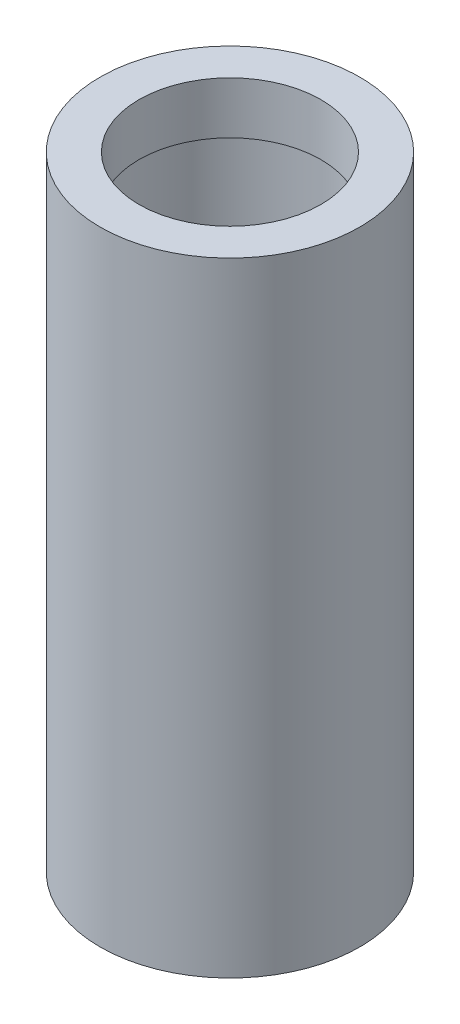
ISO-10303-21;
HEADER;
FILE_DESCRIPTION(('STEP AP214'),'2;1');
FILE_NAME('part.step','',(''),(''),'','','');
FILE_SCHEMA(('AUTOMOTIVE_DESIGN { 1 0 10303 214 1 1 1 1 }'));
ENDSEC;
DATA;
#1=APPLICATION_CONTEXT('core data for automotive mechanical design processes');
#2=APPLICATION_PROTOCOL_DEFINITION('international standard','automotive_design',2000,#1);
#3=PRODUCT_CONTEXT('',#1,'mechanical');
#4=PRODUCT('Part','Part','',(#3));
#5=PRODUCT_RELATED_PRODUCT_CATEGORY('part','',(#4));
#6=PRODUCT_DEFINITION_FORMATION('','',#4);
#7=PRODUCT_DEFINITION_CONTEXT('part definition',#1,'design');
#8=PRODUCT_DEFINITION('design','',#6,#7);
#9=PRODUCT_DEFINITION_SHAPE('','',#8);
#10=(LENGTH_UNIT() NAMED_UNIT(*) SI_UNIT(.MILLI.,.METRE.));
#11=(NAMED_UNIT(*) PLANE_ANGLE_UNIT() SI_UNIT($,.RADIAN.));
#12=(NAMED_UNIT(*) SI_UNIT($,.STERADIAN.) SOLID_ANGLE_UNIT());
#13=UNCERTAINTY_MEASURE_WITH_UNIT(LENGTH_MEASURE(1.E-05),#10,'distance_accuracy_value','');
#14=(GEOMETRIC_REPRESENTATION_CONTEXT(3) GLOBAL_UNCERTAINTY_ASSIGNED_CONTEXT((#13)) GLOBAL_UNIT_ASSIGNED_CONTEXT((#10,
#11,#12)) REPRESENTATION_CONTEXT('',''));
#15=CARTESIAN_POINT('',(0.,0.,0.));
#16=DIRECTION('',(0.,0.,1.));
#17=DIRECTION('',(1.,0.,0.));
#18=AXIS2_PLACEMENT_3D('',#15,#16,#17);
#19=CARTESIAN_POINT('',(0.,120.,0.));
#20=DIRECTION('',(0.,-1.,0.));
#21=DIRECTION('',(0.,0.,-1.));
#22=AXIS2_PLACEMENT_3D('',#19,#20,#21);
#23=CYLINDRICAL_SURFACE('',#22,20.);
#24=CARTESIAN_POINT('',(0.,110.,0.));
#25=DIRECTION('',(0.,1.,0.));
#26=DIRECTION('',(0.,0.,1.));
#27=AXIS2_PLACEMENT_3D('',#24,#25,#26);
#28=CIRCLE('',#27,20.);
#29=CARTESIAN_POINT('',(0.,110.,20.));
#30=VERTEX_POINT('',#29);
#31=EDGE_CURVE('E42',#30,#30,#28,.T.);
#32=ORIENTED_EDGE('',*,*,#31,.T.);
#33=EDGE_LOOP('',(#32));
#34=FACE_BOUND('',#33,.T.);
#35=CARTESIAN_POINT('',(0.,9.99999999999997,0.));
#36=DIRECTION('',(0.,-1.,0.));
#37=DIRECTION('',(0.,0.,-1.));
#38=AXIS2_PLACEMENT_3D('',#35,#36,#37);
#39=CIRCLE('',#38,20.);
#40=CARTESIAN_POINT('',(0.,9.99999999999997,-20.));
#41=VERTEX_POINT('',#40);
#42=EDGE_CURVE('E50',#41,#41,#39,.T.);
#43=ORIENTED_EDGE('',*,*,#42,.T.);
#44=EDGE_LOOP('',(#43));
#45=FACE_BOUND('',#44,.T.);
#46=ADVANCED_FACE('F31',(#34,#45),#23,.F.);
#47=CARTESIAN_POINT('',(0.,120.,0.));
#48=DIRECTION('',(0.,1.,0.));
#49=DIRECTION('',(0.,0.,1.));
#50=AXIS2_PLACEMENT_3D('',#47,#48,#49);
#51=PLANE('',#50);
#52=CARTESIAN_POINT('',(0.,120.,0.));
#53=DIRECTION('',(0.,1.,0.));
#54=DIRECTION('',(0.,0.,1.));
#55=AXIS2_PLACEMENT_3D('',#52,#53,#54);
#56=CIRCLE('',#55,25.);
#57=CARTESIAN_POINT('',(0.,120.,25.));
#58=VERTEX_POINT('',#57);
#59=EDGE_CURVE('E10',#58,#58,#56,.T.);
#60=ORIENTED_EDGE('',*,*,#59,.T.);
#61=EDGE_LOOP('',(#60));
#62=FACE_BOUND('',#61,.T.);
#63=CARTESIAN_POINT('',(0.,120.,0.));
#64=DIRECTION('',(0.,1.,0.));
#65=DIRECTION('',(0.,0.,1.));
#66=AXIS2_PLACEMENT_3D('',#63,#64,#65);
#67=CIRCLE('',#66,17.5);
#68=CARTESIAN_POINT('',(0.,120.,17.5));
#69=VERTEX_POINT('',#68);
#70=EDGE_CURVE('E47',#69,#69,#67,.T.);
#71=ORIENTED_EDGE('',*,*,#70,.F.);
#72=EDGE_LOOP('',(#71));
#73=FACE_BOUND('',#72,.T.);
#74=ADVANCED_FACE('F73',(#62,#73),#51,.T.);
#75=CARTESIAN_POINT('',(0.,0.,0.));
#76=DIRECTION('',(0.,1.,0.));
#77=DIRECTION('',(0.,0.,1.));
#78=AXIS2_PLACEMENT_3D('',#75,#76,#77);
#79=PLANE('',#78);
#80=CARTESIAN_POINT('',(0.,0.,0.));
#81=DIRECTION('',(0.,1.,0.));
#82=DIRECTION('',(0.,0.,1.));
#83=AXIS2_PLACEMENT_3D('',#80,#81,#82);
#84=CIRCLE('',#83,25.);
#85=CARTESIAN_POINT('',(0.,0.,25.));
#86=VERTEX_POINT('',#85);
#87=EDGE_CURVE('E35',#86,#86,#84,.T.);
#88=ORIENTED_EDGE('',*,*,#87,.F.);
#89=EDGE_LOOP('',(#88));
#90=FACE_BOUND('',#89,.T.);
#91=CARTESIAN_POINT('',(0.,0.,0.));
#92=DIRECTION('',(0.,-1.,0.));
#93=DIRECTION('',(0.,0.,-1.));
#94=AXIS2_PLACEMENT_3D('',#91,#92,#93);
#95=CIRCLE('',#94,10.);
#96=CARTESIAN_POINT('',(0.,0.,-10.));
#97=VERTEX_POINT('',#96);
#98=EDGE_CURVE('E56',#97,#97,#95,.T.);
#99=ORIENTED_EDGE('',*,*,#98,.F.);
#100=EDGE_LOOP('',(#99));
#101=FACE_BOUND('',#100,.T.);
#102=ADVANCED_FACE('F71',(#90,#101),#79,.F.);
#103=CARTESIAN_POINT('',(0.,120.,0.));
#104=DIRECTION('',(0.,-1.,0.));
#105=DIRECTION('',(0.,0.,-1.));
#106=AXIS2_PLACEMENT_3D('',#103,#104,#105);
#107=CYLINDRICAL_SURFACE('',#106,25.);
#108=ORIENTED_EDGE('',*,*,#59,.F.);
#109=EDGE_LOOP('',(#108));
#110=FACE_BOUND('',#109,.T.);
#111=ORIENTED_EDGE('',*,*,#87,.T.);
#112=EDGE_LOOP('',(#111));
#113=FACE_BOUND('',#112,.T.);
#114=ADVANCED_FACE('F33',(#110,#113),#107,.T.);
#115=CARTESIAN_POINT('',(0.,110.,0.));
#116=DIRECTION('',(0.,1.,0.));
#117=DIRECTION('',(0.,0.,1.));
#118=AXIS2_PLACEMENT_3D('',#115,#116,#117);
#119=PLANE('',#118);
#120=CARTESIAN_POINT('',(0.,110.,0.));
#121=DIRECTION('',(0.,1.,0.));
#122=DIRECTION('',(0.,0.,1.));
#123=AXIS2_PLACEMENT_3D('',#120,#121,#122);
#124=CIRCLE('',#123,17.5);
#125=CARTESIAN_POINT('',(0.,110.,17.5));
#126=VERTEX_POINT('',#125);
#127=EDGE_CURVE('E46',#126,#126,#124,.T.);
#128=ORIENTED_EDGE('',*,*,#127,.T.);
#129=EDGE_LOOP('',(#128));
#130=FACE_BOUND('',#129,.T.);
#131=ORIENTED_EDGE('',*,*,#31,.F.);
#132=EDGE_LOOP('',(#131));
#133=FACE_BOUND('',#132,.T.);
#134=ADVANCED_FACE('F80',(#130,#133),#119,.F.);
#135=CARTESIAN_POINT('',(0.,110.,0.));
#136=DIRECTION('',(0.,1.,0.));
#137=DIRECTION('',(0.,0.,1.));
#138=AXIS2_PLACEMENT_3D('',#135,#136,#137);
#139=CYLINDRICAL_SURFACE('',#138,17.5);
#140=ORIENTED_EDGE('',*,*,#127,.F.);
#141=EDGE_LOOP('',(#140));
#142=FACE_BOUND('',#141,.T.);
#143=ORIENTED_EDGE('',*,*,#70,.T.);
#144=EDGE_LOOP('',(#143));
#145=FACE_BOUND('',#144,.T.);
#146=ADVANCED_FACE('F93',(#142,#145),#139,.F.);
#147=CARTESIAN_POINT('',(0.,9.99999999999997,0.));
#148=DIRECTION('',(0.,-1.,0.));
#149=DIRECTION('',(0.,0.,-1.));
#150=AXIS2_PLACEMENT_3D('',#147,#148,#149);
#151=PLANE('',#150);
#152=CARTESIAN_POINT('',(0.,9.99999999999997,0.));
#153=DIRECTION('',(0.,-1.,0.));
#154=DIRECTION('',(0.,0.,-1.));
#155=AXIS2_PLACEMENT_3D('',#152,#153,#154);
#156=CIRCLE('',#155,10.);
#157=CARTESIAN_POINT('',(0.,9.99999999999997,-10.));
#158=VERTEX_POINT('',#157);
#159=EDGE_CURVE('E55',#158,#158,#156,.T.);
#160=ORIENTED_EDGE('',*,*,#159,.T.);
#161=EDGE_LOOP('',(#160));
#162=FACE_BOUND('',#161,.T.);
#163=ORIENTED_EDGE('',*,*,#42,.F.);
#164=EDGE_LOOP('',(#163));
#165=FACE_BOUND('',#164,.T.);
#166=ADVANCED_FACE('F62',(#162,#165),#151,.F.);
#167=CARTESIAN_POINT('',(0.,9.99999999999997,0.));
#168=DIRECTION('',(0.,-1.,0.));
#169=DIRECTION('',(0.,0.,-1.));
#170=AXIS2_PLACEMENT_3D('',#167,#168,#169);
#171=CYLINDRICAL_SURFACE('',#170,10.);
#172=ORIENTED_EDGE('',*,*,#159,.F.);
#173=EDGE_LOOP('',(#172));
#174=FACE_BOUND('',#173,.T.);
#175=ORIENTED_EDGE('',*,*,#98,.T.);
#176=EDGE_LOOP('',(#175));
#177=FACE_BOUND('',#176,.T.);
#178=ADVANCED_FACE('F65',(#174,#177),#171,.F.);
#179=CLOSED_SHELL('',(#46,#74,#102,#114,#134,#146,#166,#178));
#180=MANIFOLD_SOLID_BREP('B2',#179);
#181=ADVANCED_BREP_SHAPE_REPRESENTATION('',(#18,#180),#14);
#182=SHAPE_DEFINITION_REPRESENTATION(#9,#181);
ENDSEC;
END-ISO-10303-21;
